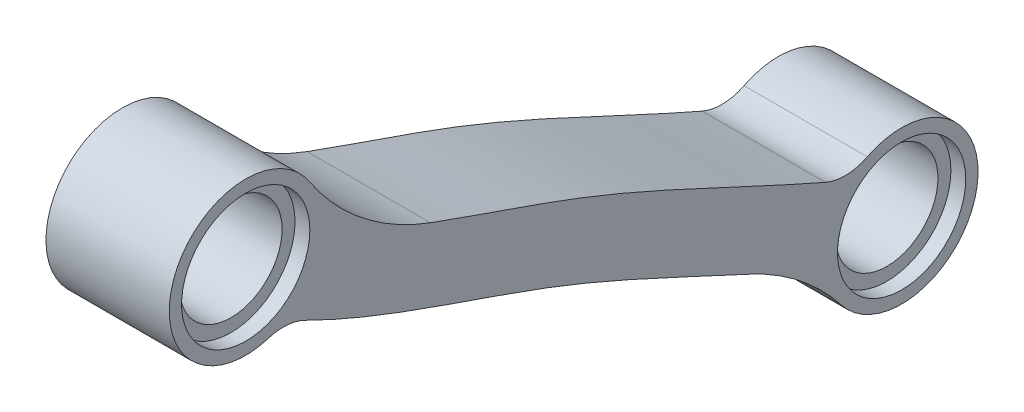
ISO-10303-21;
HEADER;
FILE_DESCRIPTION(('STEP AP214'),'2;1');
FILE_NAME('part.step','',(''),(''),'','','');
FILE_SCHEMA(('AUTOMOTIVE_DESIGN { 1 0 10303 214 1 1 1 1 }'));
ENDSEC;
DATA;
#1=APPLICATION_CONTEXT('core data for automotive mechanical design processes');
#2=APPLICATION_PROTOCOL_DEFINITION('international standard','automotive_design',2000,#1);
#3=PRODUCT_CONTEXT('',#1,'mechanical');
#4=PRODUCT('Part','Part','',(#3));
#5=PRODUCT_RELATED_PRODUCT_CATEGORY('part','',(#4));
#6=PRODUCT_DEFINITION_FORMATION('','',#4);
#7=PRODUCT_DEFINITION_CONTEXT('part definition',#1,'design');
#8=PRODUCT_DEFINITION('design','',#6,#7);
#9=PRODUCT_DEFINITION_SHAPE('','',#8);
#10=(LENGTH_UNIT() NAMED_UNIT(*) SI_UNIT(.MILLI.,.METRE.));
#11=(NAMED_UNIT(*) PLANE_ANGLE_UNIT() SI_UNIT($,.RADIAN.));
#12=(NAMED_UNIT(*) SI_UNIT($,.STERADIAN.) SOLID_ANGLE_UNIT());
#13=UNCERTAINTY_MEASURE_WITH_UNIT(LENGTH_MEASURE(1.E-05),#10,'distance_accuracy_value','');
#14=(GEOMETRIC_REPRESENTATION_CONTEXT(3) GLOBAL_UNCERTAINTY_ASSIGNED_CONTEXT((#13)) GLOBAL_UNIT_ASSIGNED_CONTEXT((#10,
#11,#12)) REPRESENTATION_CONTEXT('',''));
#15=CARTESIAN_POINT('',(0.,0.,0.));
#16=DIRECTION('',(0.,0.,1.));
#17=DIRECTION('',(1.,0.,0.));
#18=AXIS2_PLACEMENT_3D('',#15,#16,#17);
#19=CARTESIAN_POINT('',(2.5,-5.87,-12.045));
#20=DIRECTION('',(-1.,0.,0.));
#21=DIRECTION('',(0.,0.,1.));
#22=AXIS2_PLACEMENT_3D('',#19,#20,#21);
#23=CYLINDRICAL_SURFACE('',#22,2.075);
#24=CARTESIAN_POINT('',(1.9,-5.87,-12.045));
#25=DIRECTION('',(1.,0.,0.));
#26=DIRECTION('',(0.,0.,-1.));
#27=AXIS2_PLACEMENT_3D('',#24,#25,#26);
#28=CIRCLE('',#27,2.075);
#29=CARTESIAN_POINT('',(1.9,-5.87,-14.12));
#30=VERTEX_POINT('',#29);
#31=EDGE_CURVE('E166',#30,#30,#28,.T.);
#32=ORIENTED_EDGE('',*,*,#31,.T.);
#33=EDGE_LOOP('',(#32));
#34=FACE_BOUND('',#33,.T.);
#35=CARTESIAN_POINT('',(-1.9,-5.87,-12.045));
#36=DIRECTION('',(-1.,0.,0.));
#37=DIRECTION('',(0.,0.,1.));
#38=AXIS2_PLACEMENT_3D('',#35,#36,#37);
#39=CIRCLE('',#38,2.075);
#40=CARTESIAN_POINT('',(-1.9,-5.87,-9.97));
#41=VERTEX_POINT('',#40);
#42=EDGE_CURVE('E41',#41,#41,#39,.T.);
#43=ORIENTED_EDGE('',*,*,#42,.T.);
#44=EDGE_LOOP('',(#43));
#45=FACE_BOUND('',#44,.T.);
#46=ADVANCED_FACE('F37',(#34,#45),#23,.F.);
#47=CARTESIAN_POINT('',(2.5,5.62916512459887,14.555));
#48=DIRECTION('',(-1.,0.,0.));
#49=DIRECTION('',(0.,0.,1.));
#50=AXIS2_PLACEMENT_3D('',#47,#48,#49);
#51=CYLINDRICAL_SURFACE('',#50,2.075);
#52=CARTESIAN_POINT('',(1.9,5.62916512459887,14.555));
#53=DIRECTION('',(1.,0.,0.));
#54=DIRECTION('',(0.,0.,-1.));
#55=AXIS2_PLACEMENT_3D('',#52,#53,#54);
#56=CIRCLE('',#55,2.075);
#57=CARTESIAN_POINT('',(1.9,5.62916512459887,12.48));
#58=VERTEX_POINT('',#57);
#59=EDGE_CURVE('E163',#58,#58,#56,.T.);
#60=ORIENTED_EDGE('',*,*,#59,.T.);
#61=EDGE_LOOP('',(#60));
#62=FACE_BOUND('',#61,.T.);
#63=CARTESIAN_POINT('',(-1.9,5.62916512459887,14.555));
#64=DIRECTION('',(-1.,0.,0.));
#65=DIRECTION('',(0.,0.,1.));
#66=AXIS2_PLACEMENT_3D('',#63,#64,#65);
#67=CIRCLE('',#66,2.075);
#68=CARTESIAN_POINT('',(-1.9,5.62916512459887,16.63));
#69=VERTEX_POINT('',#68);
#70=EDGE_CURVE('E170',#69,#69,#67,.T.);
#71=ORIENTED_EDGE('',*,*,#70,.T.);
#72=EDGE_LOOP('',(#71));
#73=FACE_BOUND('',#72,.T.);
#74=ADVANCED_FACE('F214',(#62,#73),#51,.F.);
#75=CARTESIAN_POINT('',(2.5,6.76463741079085,13.7361359378246));
#76=CARTESIAN_POINT('',(2.5,6.10232554315082,12.8177267916838));
#77=CARTESIAN_POINT('',(2.5,4.96478119723148,10.8642158421662));
#78=CARTESIAN_POINT('',(2.5,3.1788131751022,6.58672675063141));
#79=CARTESIAN_POINT('',(2.5,1.72609315040334,1.89282815120184));
#80=CARTESIAN_POINT('',(2.5,-0.241853497726368,-2.66434209307869));
#81=CARTESIAN_POINT('',(2.5,-1.79151158529708,-5.95493613178523));
#82=CARTESIAN_POINT('',(2.5,-3.28993591628783,-9.2180454775434));
#83=CARTESIAN_POINT('',(2.5,-4.16052964631979,-11.3940830085414));
#84=CARTESIAN_POINT('',(2.5,-4.5478871860698,-12.5057144798331));
#85=B_SPLINE_CURVE_WITH_KNOTS('',3,(#75,#76,#77,#78,#79,#80,#81,#82,#83,#84),.UNSPECIFIED.,.F.,
.F.,(4,1,1,1,1,1,1,4),(0.,0.125,0.25,0.5,0.625,0.75,0.875,1.),.UNSPECIFIED.);
#86=DIRECTION('',(-1.,0.,0.));
#87=VECTOR('',#86,1.);
#88=SURFACE_OF_LINEAR_EXTRUSION('',#85,#87);
#89=CARTESIAN_POINT('',(2.5,3.44568911055969,7.06609687072258));
#90=VERTEX_POINT('',#89);
#91=CARTESIAN_POINT('',(2.5,-3.14656661565201,-8.96056349653879));
#92=VERTEX_POINT('',#91);
#93=EDGE_CURVE('E128',#90,#92,#85,.T.);
#94=ORIENTED_EDGE('',*,*,#93,.T.);
#95=DIRECTION('',(-1.,0.,0.));
#96=VECTOR('',#95,1.);
#97=CARTESIAN_POINT('',(2.5,-3.14656661565228,-8.96056349653941));
#98=LINE('',#97,#96);
#99=CARTESIAN_POINT('',(-2.5,-3.14656661565201,-8.96056349653879));
#100=VERTEX_POINT('',#99);
#101=EDGE_CURVE('E150',#92,#100,#98,.T.);
#102=ORIENTED_EDGE('',*,*,#101,.T.);
#103=CARTESIAN_POINT('',(-2.5,6.76463741079085,13.7361359378246));
#104=CARTESIAN_POINT('',(-2.5,6.10232554315082,12.8177267916838));
#105=CARTESIAN_POINT('',(-2.5,4.96478119723148,10.8642158421662));
#106=CARTESIAN_POINT('',(-2.5,3.1788131751022,6.58672675063141));
#107=CARTESIAN_POINT('',(-2.5,1.72609315040334,1.89282815120184));
#108=CARTESIAN_POINT('',(-2.5,-0.241853497726368,-2.66434209307869));
#109=CARTESIAN_POINT('',(-2.5,-1.79151158529708,-5.95493613178523));
#110=CARTESIAN_POINT('',(-2.5,-3.28993591628783,-9.2180454775434));
#111=CARTESIAN_POINT('',(-2.5,-4.16052964631979,-11.3940830085414));
#112=CARTESIAN_POINT('',(-2.5,-4.5478871860698,-12.5057144798331));
#113=B_SPLINE_CURVE_WITH_KNOTS('',3,(#103,#104,#105,#106,#107,#108,#109,#110,#111,#112),
.UNSPECIFIED.,.F.,.F.,(4,1,1,1,1,1,1,4),(0.,0.125,0.25,0.5,0.625,0.75,0.875,1.),.UNSPECIFIED.);
#114=CARTESIAN_POINT('',(-2.5,3.44568911055969,7.06609687072258));
#115=VERTEX_POINT('',#114);
#116=EDGE_CURVE('E169',#115,#100,#113,.T.);
#117=ORIENTED_EDGE('',*,*,#116,.F.);
#118=DIRECTION('',(-1.,0.,0.));
#119=VECTOR('',#118,1.);
#120=CARTESIAN_POINT('',(-2.5,3.44568911055969,7.06609687072258));
#121=LINE('',#120,#119);
#122=EDGE_CURVE('E114',#115,#90,#121,.F.);
#123=ORIENTED_EDGE('',*,*,#122,.T.);
#124=EDGE_LOOP('',(#94,#102,#117,#123));
#125=FACE_BOUND('',#124,.T.);
#126=ADVANCED_FACE('F209',(#125),#88,.T.);
#127=CARTESIAN_POINT('',(2.5,5.62916512459887,14.555));
#128=DIRECTION('',(-1.,0.,0.));
#129=DIRECTION('',(0.,0.,1.));
#130=AXIS2_PLACEMENT_3D('',#127,#128,#129);
#131=CYLINDRICAL_SURFACE('',#130,3.10000000000017);
#132=CARTESIAN_POINT('',(-2.5,5.62916512459887,14.555));
#133=DIRECTION('',(1.,0.,0.));
#134=DIRECTION('',(0.,0.,-1.));
#135=AXIS2_PLACEMENT_3D('',#132,#133,#134);
#136=CIRCLE('',#135,3.10000000000017);
#137=CARTESIAN_POINT('',(-2.5,7.33319893236661,11.9653535411208));
#138=VERTEX_POINT('',#137);
#139=CARTESIAN_POINT('',(-2.5,2.67168496025591,13.6258546521029));
#140=VERTEX_POINT('',#139);
#141=EDGE_CURVE('E134',#138,#140,#136,.T.);
#142=ORIENTED_EDGE('',*,*,#141,.T.);
#143=DIRECTION('',(-1.,0.,0.));
#144=VECTOR('',#143,1.);
#145=CARTESIAN_POINT('',(2.5,2.67168496025591,13.6258546521029));
#146=LINE('',#145,#144);
#147=CARTESIAN_POINT('',(2.5,2.67168496025591,13.6258546521029));
#148=VERTEX_POINT('',#147);
#149=EDGE_CURVE('E60',#140,#148,#146,.F.);
#150=ORIENTED_EDGE('',*,*,#149,.T.);
#151=CARTESIAN_POINT('',(2.5,5.62916512459887,14.555));
#152=DIRECTION('',(1.,0.,0.));
#153=DIRECTION('',(0.,0.,-1.));
#154=AXIS2_PLACEMENT_3D('',#151,#152,#153);
#155=CIRCLE('',#154,3.10000000000017);
#156=CARTESIAN_POINT('',(2.5,7.33319893236661,11.9653535411208));
#157=VERTEX_POINT('',#156);
#158=EDGE_CURVE('E132',#157,#148,#155,.T.);
#159=ORIENTED_EDGE('',*,*,#158,.F.);
#160=DIRECTION('',(-1.,0.,0.));
#161=VECTOR('',#160,1.);
#162=CARTESIAN_POINT('',(2.5,7.33319893236661,11.9653535411208));
#163=LINE('',#162,#161);
#164=EDGE_CURVE('E141',#157,#138,#163,.T.);
#165=ORIENTED_EDGE('',*,*,#164,.T.);
#166=EDGE_LOOP('',(#142,#150,#159,#165));
#167=FACE_BOUND('',#166,.T.);
#168=ADVANCED_FACE('F213',(#167),#131,.T.);
#169=CARTESIAN_POINT('',(2.5,4.49378417223535,15.3738113609542));
#170=CARTESIAN_POINT('',(2.5,4.11406195573929,14.8472807387713));
#171=CARTESIAN_POINT('',(2.5,3.40063863910023,13.7491235540397));
#172=CARTESIAN_POINT('',(2.5,2.19652530056417,11.5077627307689));
#173=CARTESIAN_POINT('',(2.5,0.994573418696707,8.61756440568091));
#174=CARTESIAN_POINT('',(2.5,-0.202666732004999,5.13434083447357));
#175=CARTESIAN_POINT('',(2.5,-1.38003850962497,1.76066790014413));
#176=CARTESIAN_POINT('',(2.5,-2.78360156040152,-1.48690259939128));
#177=CARTESIAN_POINT('',(2.5,-4.323813238797,-4.76110402572934));
#178=CARTESIAN_POINT('',(2.5,-5.85311747677076,-8.08608721470596));
#179=CARTESIAN_POINT('',(2.5,-6.78322601156165,-10.4105821436323));
#180=CARTESIAN_POINT('',(2.5,-7.19222048519864,-11.5842407178929));
#181=B_SPLINE_CURVE_WITH_KNOTS('',3,(#169,#170,#171,#172,#173,#174,#175,#176,#177,#178,#179,
#180),.UNSPECIFIED.,.F.,.F.,(4,1,1,1,1,1,1,1,1,4),(0.,0.0625,0.125,0.25,0.375,0.5,0.625,0.75,
0.875,1.),.UNSPECIFIED.);
#182=DIRECTION('',(-1.,0.,0.));
#183=VECTOR('',#182,1.);
#184=SURFACE_OF_LINEAR_EXTRUSION('',#181,#183);
#185=CARTESIAN_POINT('',(2.5,2.55294617572628,12.132896542686));
#186=VERTEX_POINT('',#185);
#187=CARTESIAN_POINT('',(2.5,-4.83763630634533,-5.88475766552253));
#188=VERTEX_POINT('',#187);
#189=EDGE_CURVE('E247',#186,#188,#181,.T.);
#190=ORIENTED_EDGE('',*,*,#189,.F.);
#191=DIRECTION('',(-1.,0.,0.));
#192=VECTOR('',#191,1.);
#193=CARTESIAN_POINT('',(2.5,2.55294617572628,12.132896542686));
#194=LINE('',#193,#192);
#195=CARTESIAN_POINT('',(-2.5,2.55294617572628,12.132896542686));
#196=VERTEX_POINT('',#195);
#197=EDGE_CURVE('E155',#186,#196,#194,.T.);
#198=ORIENTED_EDGE('',*,*,#197,.T.);
#199=CARTESIAN_POINT('',(-2.5,4.49378417223535,15.3738113609542));
#200=CARTESIAN_POINT('',(-2.5,4.11406195573929,14.8472807387713));
#201=CARTESIAN_POINT('',(-2.5,3.40063863910023,13.7491235540397));
#202=CARTESIAN_POINT('',(-2.5,2.19652530056417,11.5077627307689));
#203=CARTESIAN_POINT('',(-2.5,0.994573418696707,8.61756440568091));
#204=CARTESIAN_POINT('',(-2.5,-0.202666732004999,5.13434083447357));
#205=CARTESIAN_POINT('',(-2.5,-1.38003850962497,1.76066790014413));
#206=CARTESIAN_POINT('',(-2.5,-2.78360156040152,-1.48690259939128));
#207=CARTESIAN_POINT('',(-2.5,-4.323813238797,-4.76110402572934));
#208=CARTESIAN_POINT('',(-2.5,-5.85311747677076,-8.08608721470596));
#209=CARTESIAN_POINT('',(-2.5,-6.78322601156165,-10.4105821436323));
#210=CARTESIAN_POINT('',(-2.5,-7.19222048519864,-11.5842407178929));
#211=B_SPLINE_CURVE_WITH_KNOTS('',3,(#199,#200,#201,#202,#203,#204,#205,#206,#207,#208,#209,
#210),.UNSPECIFIED.,.F.,.F.,(4,1,1,1,1,1,1,1,1,4),(0.,0.0625,0.125,0.25,0.375,0.5,0.625,0.75,
0.875,1.),.UNSPECIFIED.);
#212=CARTESIAN_POINT('',(-2.5,-4.83763630634533,-5.88475766552253));
#213=VERTEX_POINT('',#212);
#214=EDGE_CURVE('E129',#196,#213,#211,.T.);
#215=ORIENTED_EDGE('',*,*,#214,.T.);
#216=DIRECTION('',(-1.,0.,0.));
#217=VECTOR('',#216,1.);
#218=CARTESIAN_POINT('',(-2.5,-4.83763630634533,-5.88475766552253));
#219=LINE('',#218,#217);
#220=EDGE_CURVE('E111',#213,#188,#219,.F.);
#221=ORIENTED_EDGE('',*,*,#220,.T.);
#222=EDGE_LOOP('',(#190,#198,#215,#221));
#223=FACE_BOUND('',#222,.T.);
#224=ADVANCED_FACE('F244',(#223),#184,.F.);
#225=CARTESIAN_POINT('',(2.5,-5.87,-12.045));
#226=DIRECTION('',(-1.,0.,0.));
#227=DIRECTION('',(0.,0.,1.));
#228=AXIS2_PLACEMENT_3D('',#225,#226,#227);
#229=CYLINDRICAL_SURFACE('',#228,3.10000000000011);
#230=CARTESIAN_POINT('',(-2.5,-5.87,-12.045));
#231=DIRECTION('',(1.,0.,0.));
#232=DIRECTION('',(0.,0.,-1.));
#233=AXIS2_PLACEMENT_3D('',#230,#231,#232);
#234=CIRCLE('',#233,3.10000000000011);
#235=CARTESIAN_POINT('',(-2.5,-7.77666493298273,-9.60069461127815));
#236=VERTEX_POINT('',#235);
#237=CARTESIAN_POINT('',(-2.5,-3.09945568757233,-10.6542864375166));
#238=VERTEX_POINT('',#237);
#239=EDGE_CURVE('E120',#236,#238,#234,.T.);
#240=ORIENTED_EDGE('',*,*,#239,.T.);
#241=DIRECTION('',(-1.,0.,0.));
#242=VECTOR('',#241,1.);
#243=CARTESIAN_POINT('',(2.5,-3.09945568757232,-10.6542864375166));
#244=LINE('',#243,#242);
#245=CARTESIAN_POINT('',(2.5,-3.09945568757233,-10.6542864375166));
#246=VERTEX_POINT('',#245);
#247=EDGE_CURVE('E153',#238,#246,#244,.F.);
#248=ORIENTED_EDGE('',*,*,#247,.T.);
#249=CARTESIAN_POINT('',(2.5,-5.87,-12.045));
#250=DIRECTION('',(1.,0.,0.));
#251=DIRECTION('',(0.,0.,-1.));
#252=AXIS2_PLACEMENT_3D('',#249,#250,#251);
#253=CIRCLE('',#252,3.10000000000011);
#254=CARTESIAN_POINT('',(2.5,-7.77666493298273,-9.60069461127815));
#255=VERTEX_POINT('',#254);
#256=EDGE_CURVE('E123',#255,#246,#253,.T.);
#257=ORIENTED_EDGE('',*,*,#256,.F.);
#258=DIRECTION('',(-1.,0.,0.));
#259=VECTOR('',#258,1.);
#260=CARTESIAN_POINT('',(2.5,-7.77666493298273,-9.60069461127815));
#261=LINE('',#260,#259);
#262=EDGE_CURVE('E109',#255,#236,#261,.T.);
#263=ORIENTED_EDGE('',*,*,#262,.T.);
#264=EDGE_LOOP('',(#240,#248,#257,#263));
#265=FACE_BOUND('',#264,.T.);
#266=ADVANCED_FACE('F119',(#265),#229,.T.);
#267=CARTESIAN_POINT('',(2.5,0.,0.));
#268=DIRECTION('',(1.,0.,0.));
#269=DIRECTION('',(0.,0.,-1.));
#270=AXIS2_PLACEMENT_3D('',#267,#268,#269);
#271=PLANE('',#270);
#272=CARTESIAN_POINT('',(2.5,5.62916512459887,14.555));
#273=DIRECTION('',(1.,0.,0.));
#274=DIRECTION('',(0.,0.,-1.));
#275=AXIS2_PLACEMENT_3D('',#272,#273,#274);
#276=CIRCLE('',#275,2.6);
#277=CARTESIAN_POINT('',(2.5,5.62916512459887,11.955));
#278=VERTEX_POINT('',#277);
#279=EDGE_CURVE('E193',#278,#278,#276,.T.);
#280=ORIENTED_EDGE('',*,*,#279,.F.);
#281=EDGE_LOOP('',(#280));
#282=FACE_BOUND('',#281,.T.);
#283=CARTESIAN_POINT('',(2.5,-5.87,-12.045));
#284=DIRECTION('',(1.,0.,0.));
#285=DIRECTION('',(0.,0.,-1.));
#286=AXIS2_PLACEMENT_3D('',#283,#284,#285);
#287=CIRCLE('',#286,2.6);
#288=CARTESIAN_POINT('',(2.5,-5.87,-14.645));
#289=VERTEX_POINT('',#288);
#290=EDGE_CURVE('E176',#289,#289,#287,.T.);
#291=ORIENTED_EDGE('',*,*,#290,.F.);
#292=EDGE_LOOP('',(#291));
#293=FACE_BOUND('',#292,.T.);
#294=ORIENTED_EDGE('',*,*,#93,.F.);
#295=CARTESIAN_POINT('',(2.5,12.8300821832301,3.6116552866721));
#296=DIRECTION('',(1.,0.,0.));
#297=DIRECTION('',(0.,0.,-1.));
#298=AXIS2_PLACEMENT_3D('',#295,#296,#297);
#299=CIRCLE('',#298,10.);
#300=EDGE_CURVE('E148',#90,#157,#299,.F.);
#301=ORIENTED_EDGE('',*,*,#300,.T.);
#302=ORIENTED_EDGE('',*,*,#158,.T.);
#303=CARTESIAN_POINT('',(2.5,0.763633241325068,13.0264060405563));
#304=DIRECTION('',(1.,0.,0.));
#305=DIRECTION('',(0.,0.,-1.));
#306=AXIS2_PLACEMENT_3D('',#303,#304,#305);
#307=CIRCLE('',#306,2.);
#308=EDGE_CURVE('E11',#148,#186,#307,.F.);
#309=ORIENTED_EDGE('',*,*,#308,.T.);
#310=ORIENTED_EDGE('',*,*,#189,.T.);
#311=CARTESIAN_POINT('',(2.5,-13.9271969748623,-1.71583851862733));
#312=DIRECTION('',(1.,0.,0.));
#313=DIRECTION('',(0.,0.,-1.));
#314=AXIS2_PLACEMENT_3D('',#311,#312,#313);
#315=CIRCLE('',#314,10.);
#316=EDGE_CURVE('E113',#188,#255,#315,.F.);
#317=ORIENTED_EDGE('',*,*,#316,.T.);
#318=ORIENTED_EDGE('',*,*,#256,.T.);
#319=CARTESIAN_POINT('',(2.5,-1.31200774407067,-9.75705188107568));
#320=DIRECTION('',(1.,0.,0.));
#321=DIRECTION('',(0.,0.,-1.));
#322=AXIS2_PLACEMENT_3D('',#319,#320,#321);
#323=CIRCLE('',#322,2.);
#324=EDGE_CURVE('E160',#246,#92,#323,.F.);
#325=ORIENTED_EDGE('',*,*,#324,.T.);
#326=EDGE_LOOP('',(#294,#301,#302,#309,#310,#317,#318,#325));
#327=FACE_BOUND('',#326,.T.);
#328=ADVANCED_FACE('F243',(#282,#293,#327),#271,.T.);
#329=CARTESIAN_POINT('',(-2.5,0.,0.));
#330=DIRECTION('',(1.,0.,0.));
#331=DIRECTION('',(0.,0.,-1.));
#332=AXIS2_PLACEMENT_3D('',#329,#330,#331);
#333=PLANE('',#332);
#334=CARTESIAN_POINT('',(-2.5,5.62916512459887,14.555));
#335=DIRECTION('',(-1.,0.,0.));
#336=DIRECTION('',(0.,0.,1.));
#337=AXIS2_PLACEMENT_3D('',#334,#335,#336);
#338=CIRCLE('',#337,2.6);
#339=CARTESIAN_POINT('',(-2.5,5.62916512459887,17.155));
#340=VERTEX_POINT('',#339);
#341=EDGE_CURVE('E178',#340,#340,#338,.T.);
#342=ORIENTED_EDGE('',*,*,#341,.F.);
#343=EDGE_LOOP('',(#342));
#344=FACE_BOUND('',#343,.T.);
#345=CARTESIAN_POINT('',(-2.5,-5.87,-12.045));
#346=DIRECTION('',(-1.,0.,0.));
#347=DIRECTION('',(0.,0.,1.));
#348=AXIS2_PLACEMENT_3D('',#345,#346,#347);
#349=CIRCLE('',#348,2.6);
#350=CARTESIAN_POINT('',(-2.5,-5.87,-9.445));
#351=VERTEX_POINT('',#350);
#352=EDGE_CURVE('E188',#351,#351,#349,.T.);
#353=ORIENTED_EDGE('',*,*,#352,.F.);
#354=EDGE_LOOP('',(#353));
#355=FACE_BOUND('',#354,.T.);
#356=ORIENTED_EDGE('',*,*,#141,.F.);
#357=CARTESIAN_POINT('',(-2.5,12.8300821832301,3.6116552866721));
#358=DIRECTION('',(1.,0.,0.));
#359=DIRECTION('',(0.,0.,-1.));
#360=AXIS2_PLACEMENT_3D('',#357,#358,#359);
#361=CIRCLE('',#360,10.);
#362=EDGE_CURVE('E146',#138,#115,#361,.T.);
#363=ORIENTED_EDGE('',*,*,#362,.T.);
#364=ORIENTED_EDGE('',*,*,#116,.T.);
#365=CARTESIAN_POINT('',(-2.5,-1.31200774407067,-9.75705188107568));
#366=DIRECTION('',(1.,0.,0.));
#367=DIRECTION('',(0.,0.,-1.));
#368=AXIS2_PLACEMENT_3D('',#365,#366,#367);
#369=CIRCLE('',#368,2.);
#370=EDGE_CURVE('E127',#100,#238,#369,.T.);
#371=ORIENTED_EDGE('',*,*,#370,.T.);
#372=ORIENTED_EDGE('',*,*,#239,.F.);
#373=CARTESIAN_POINT('',(-2.5,-13.9271969748623,-1.71583851862733));
#374=DIRECTION('',(1.,0.,0.));
#375=DIRECTION('',(0.,0.,-1.));
#376=AXIS2_PLACEMENT_3D('',#373,#374,#375);
#377=CIRCLE('',#376,10.);
#378=EDGE_CURVE('E105',#236,#213,#377,.T.);
#379=ORIENTED_EDGE('',*,*,#378,.T.);
#380=ORIENTED_EDGE('',*,*,#214,.F.);
#381=CARTESIAN_POINT('',(-2.5,0.763633241325068,13.0264060405563));
#382=DIRECTION('',(1.,0.,0.));
#383=DIRECTION('',(0.,0.,-1.));
#384=AXIS2_PLACEMENT_3D('',#381,#382,#383);
#385=CIRCLE('',#384,2.);
#386=EDGE_CURVE('E46',#196,#140,#385,.T.);
#387=ORIENTED_EDGE('',*,*,#386,.T.);
#388=EDGE_LOOP('',(#356,#363,#364,#371,#372,#379,#380,#387));
#389=FACE_BOUND('',#388,.T.);
#390=ADVANCED_FACE('F125',(#344,#355,#389),#333,.F.);
#391=CARTESIAN_POINT('',(0.,-13.9271969748623,-1.71583851862733));
#392=DIRECTION('',(-1.,0.,0.));
#393=DIRECTION('',(0.,0.,1.));
#394=AXIS2_PLACEMENT_3D('',#391,#392,#393);
#395=CYLINDRICAL_SURFACE('',#394,10.);
#396=ORIENTED_EDGE('',*,*,#316,.F.);
#397=ORIENTED_EDGE('',*,*,#220,.F.);
#398=ORIENTED_EDGE('',*,*,#378,.F.);
#399=ORIENTED_EDGE('',*,*,#262,.F.);
#400=EDGE_LOOP('',(#396,#397,#398,#399));
#401=FACE_BOUND('',#400,.T.);
#402=ADVANCED_FACE('F108',(#401),#395,.F.);
#403=CARTESIAN_POINT('',(0.,12.8300821832301,3.6116552866721));
#404=DIRECTION('',(-1.,0.,0.));
#405=DIRECTION('',(0.,0.,1.));
#406=AXIS2_PLACEMENT_3D('',#403,#404,#405);
#407=CYLINDRICAL_SURFACE('',#406,10.);
#408=ORIENTED_EDGE('',*,*,#300,.F.);
#409=ORIENTED_EDGE('',*,*,#122,.F.);
#410=ORIENTED_EDGE('',*,*,#362,.F.);
#411=ORIENTED_EDGE('',*,*,#164,.F.);
#412=EDGE_LOOP('',(#408,#409,#410,#411));
#413=FACE_BOUND('',#412,.T.);
#414=ADVANCED_FACE('F219',(#413),#407,.F.);
#415=CARTESIAN_POINT('',(0.,-1.31200774407067,-9.75705188107568));
#416=DIRECTION('',(-1.,0.,0.));
#417=DIRECTION('',(0.,0.,1.));
#418=AXIS2_PLACEMENT_3D('',#415,#416,#417);
#419=CYLINDRICAL_SURFACE('',#418,2.);
#420=ORIENTED_EDGE('',*,*,#324,.F.);
#421=ORIENTED_EDGE('',*,*,#247,.F.);
#422=ORIENTED_EDGE('',*,*,#370,.F.);
#423=ORIENTED_EDGE('',*,*,#101,.F.);
#424=EDGE_LOOP('',(#420,#421,#422,#423));
#425=FACE_BOUND('',#424,.T.);
#426=ADVANCED_FACE('F221',(#425),#419,.F.);
#427=CARTESIAN_POINT('',(0.,0.763633241325068,13.0264060405563));
#428=DIRECTION('',(-1.,0.,0.));
#429=DIRECTION('',(0.,0.,1.));
#430=AXIS2_PLACEMENT_3D('',#427,#428,#429);
#431=CYLINDRICAL_SURFACE('',#430,2.);
#432=ORIENTED_EDGE('',*,*,#308,.F.);
#433=ORIENTED_EDGE('',*,*,#149,.F.);
#434=ORIENTED_EDGE('',*,*,#386,.F.);
#435=ORIENTED_EDGE('',*,*,#197,.F.);
#436=EDGE_LOOP('',(#432,#433,#434,#435));
#437=FACE_BOUND('',#436,.T.);
#438=ADVANCED_FACE('F39',(#437),#431,.F.);
#439=CARTESIAN_POINT('',(1.9,-5.87,-12.045));
#440=DIRECTION('',(1.,0.,0.));
#441=DIRECTION('',(0.,0.,-1.));
#442=AXIS2_PLACEMENT_3D('',#439,#440,#441);
#443=CYLINDRICAL_SURFACE('',#442,2.6);
#444=CARTESIAN_POINT('',(1.9,-5.87,-12.045));
#445=DIRECTION('',(1.,0.,0.));
#446=DIRECTION('',(0.,0.,-1.));
#447=AXIS2_PLACEMENT_3D('',#444,#445,#446);
#448=CIRCLE('',#447,2.6);
#449=CARTESIAN_POINT('',(1.9,-5.87,-14.645));
#450=VERTEX_POINT('',#449);
#451=EDGE_CURVE('E196',#450,#450,#448,.T.);
#452=ORIENTED_EDGE('',*,*,#451,.F.);
#453=EDGE_LOOP('',(#452));
#454=FACE_BOUND('',#453,.T.);
#455=ORIENTED_EDGE('',*,*,#290,.T.);
#456=EDGE_LOOP('',(#455));
#457=FACE_BOUND('',#456,.T.);
#458=ADVANCED_FACE('F228',(#454,#457),#443,.F.);
#459=CARTESIAN_POINT('',(1.9,-5.87,-12.045));
#460=DIRECTION('',(1.,0.,0.));
#461=DIRECTION('',(0.,0.,-1.));
#462=AXIS2_PLACEMENT_3D('',#459,#460,#461);
#463=PLANE('',#462);
#464=ORIENTED_EDGE('',*,*,#31,.F.);
#465=EDGE_LOOP('',(#464));
#466=FACE_BOUND('',#465,.T.);
#467=ORIENTED_EDGE('',*,*,#451,.T.);
#468=EDGE_LOOP('',(#467));
#469=FACE_BOUND('',#468,.T.);
#470=ADVANCED_FACE('F283',(#466,#469),#463,.T.);
#471=CARTESIAN_POINT('',(1.9,5.62916512459887,14.555));
#472=DIRECTION('',(1.,0.,0.));
#473=DIRECTION('',(0.,0.,-1.));
#474=AXIS2_PLACEMENT_3D('',#471,#472,#473);
#475=CYLINDRICAL_SURFACE('',#474,2.6);
#476=CARTESIAN_POINT('',(1.9,5.62916512459887,14.555));
#477=DIRECTION('',(1.,0.,0.));
#478=DIRECTION('',(0.,0.,-1.));
#479=AXIS2_PLACEMENT_3D('',#476,#477,#478);
#480=CIRCLE('',#479,2.6);
#481=CARTESIAN_POINT('',(1.9,5.62916512459887,11.955));
#482=VERTEX_POINT('',#481);
#483=EDGE_CURVE('E167',#482,#482,#480,.T.);
#484=ORIENTED_EDGE('',*,*,#483,.F.);
#485=EDGE_LOOP('',(#484));
#486=FACE_BOUND('',#485,.T.);
#487=ORIENTED_EDGE('',*,*,#279,.T.);
#488=EDGE_LOOP('',(#487));
#489=FACE_BOUND('',#488,.T.);
#490=ADVANCED_FACE('F287',(#486,#489),#475,.F.);
#491=CARTESIAN_POINT('',(1.9,5.62916512459887,14.555));
#492=DIRECTION('',(1.,0.,0.));
#493=DIRECTION('',(0.,0.,-1.));
#494=AXIS2_PLACEMENT_3D('',#491,#492,#493);
#495=PLANE('',#494);
#496=ORIENTED_EDGE('',*,*,#59,.F.);
#497=EDGE_LOOP('',(#496));
#498=FACE_BOUND('',#497,.T.);
#499=ORIENTED_EDGE('',*,*,#483,.T.);
#500=EDGE_LOOP('',(#499));
#501=FACE_BOUND('',#500,.T.);
#502=ADVANCED_FACE('F291',(#498,#501),#495,.T.);
#503=CARTESIAN_POINT('',(-1.9,-5.87,-12.045));
#504=DIRECTION('',(-1.,0.,0.));
#505=DIRECTION('',(0.,0.,1.));
#506=AXIS2_PLACEMENT_3D('',#503,#504,#505);
#507=CYLINDRICAL_SURFACE('',#506,2.6);
#508=CARTESIAN_POINT('',(-1.9,-5.87,-12.045));
#509=DIRECTION('',(-1.,0.,0.));
#510=DIRECTION('',(0.,0.,1.));
#511=AXIS2_PLACEMENT_3D('',#508,#509,#510);
#512=CIRCLE('',#511,2.6);
#513=CARTESIAN_POINT('',(-1.9,-5.87,-9.445));
#514=VERTEX_POINT('',#513);
#515=EDGE_CURVE('E183',#514,#514,#512,.T.);
#516=ORIENTED_EDGE('',*,*,#515,.F.);
#517=EDGE_LOOP('',(#516));
#518=FACE_BOUND('',#517,.T.);
#519=ORIENTED_EDGE('',*,*,#352,.T.);
#520=EDGE_LOOP('',(#519));
#521=FACE_BOUND('',#520,.T.);
#522=ADVANCED_FACE('F295',(#518,#521),#507,.F.);
#523=CARTESIAN_POINT('',(-1.9,-5.87,-12.045));
#524=DIRECTION('',(-1.,0.,0.));
#525=DIRECTION('',(0.,0.,1.));
#526=AXIS2_PLACEMENT_3D('',#523,#524,#525);
#527=PLANE('',#526);
#528=ORIENTED_EDGE('',*,*,#42,.F.);
#529=EDGE_LOOP('',(#528));
#530=FACE_BOUND('',#529,.T.);
#531=ORIENTED_EDGE('',*,*,#515,.T.);
#532=EDGE_LOOP('',(#531));
#533=FACE_BOUND('',#532,.T.);
#534=ADVANCED_FACE('F299',(#530,#533),#527,.T.);
#535=CARTESIAN_POINT('',(-1.9,5.62916512459887,14.555));
#536=DIRECTION('',(-1.,0.,0.));
#537=DIRECTION('',(0.,0.,1.));
#538=AXIS2_PLACEMENT_3D('',#535,#536,#537);
#539=CYLINDRICAL_SURFACE('',#538,2.6);
#540=CARTESIAN_POINT('',(-1.9,5.62916512459887,14.555));
#541=DIRECTION('',(-1.,0.,0.));
#542=DIRECTION('',(0.,0.,1.));
#543=AXIS2_PLACEMENT_3D('',#540,#541,#542);
#544=CIRCLE('',#543,2.6);
#545=CARTESIAN_POINT('',(-1.9,5.62916512459887,17.155));
#546=VERTEX_POINT('',#545);
#547=EDGE_CURVE('E172',#546,#546,#544,.T.);
#548=ORIENTED_EDGE('',*,*,#547,.F.);
#549=EDGE_LOOP('',(#548));
#550=FACE_BOUND('',#549,.T.);
#551=ORIENTED_EDGE('',*,*,#341,.T.);
#552=EDGE_LOOP('',(#551));
#553=FACE_BOUND('',#552,.T.);
#554=ADVANCED_FACE('F303',(#550,#553),#539,.F.);
#555=CARTESIAN_POINT('',(-1.9,5.62916512459887,14.555));
#556=DIRECTION('',(-1.,0.,0.));
#557=DIRECTION('',(0.,0.,1.));
#558=AXIS2_PLACEMENT_3D('',#555,#556,#557);
#559=PLANE('',#558);
#560=ORIENTED_EDGE('',*,*,#70,.F.);
#561=EDGE_LOOP('',(#560));
#562=FACE_BOUND('',#561,.T.);
#563=ORIENTED_EDGE('',*,*,#547,.T.);
#564=EDGE_LOOP('',(#563));
#565=FACE_BOUND('',#564,.T.);
#566=ADVANCED_FACE('F307',(#562,#565),#559,.T.);
#567=CLOSED_SHELL('',(#46,#74,#126,#168,#224,#266,#328,#390,#402,#414,#426,#438,#458,#470,#490,
#502,#522,#534,#554,#566));
#568=MANIFOLD_SOLID_BREP('B2',#567);
#569=ADVANCED_BREP_SHAPE_REPRESENTATION('',(#18,#568),#14);
#570=SHAPE_DEFINITION_REPRESENTATION(#9,#569);
ENDSEC;
END-ISO-10303-21;
